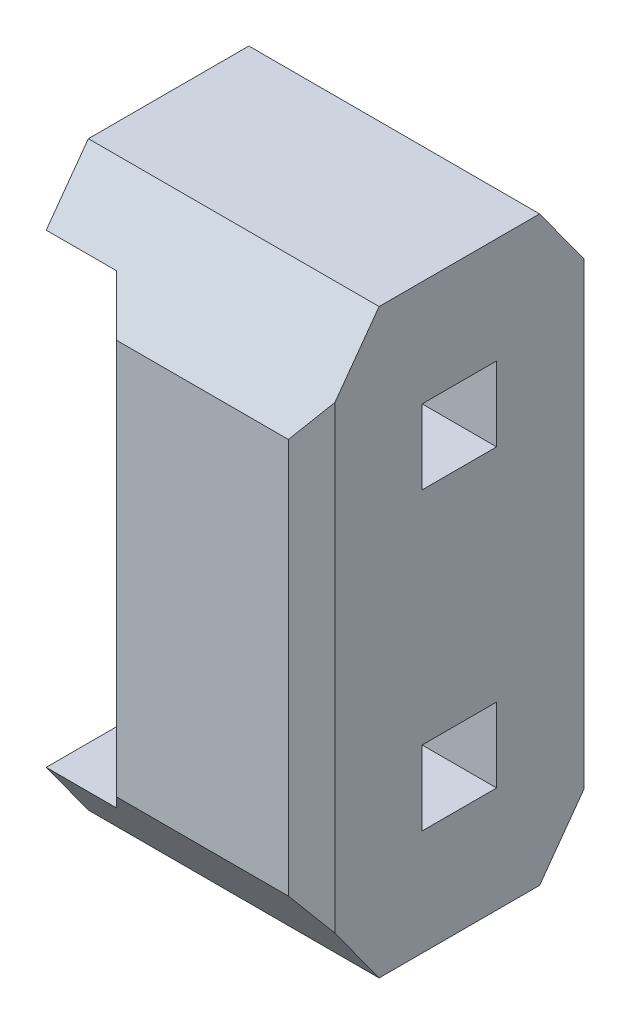
ISO-10303-21;
HEADER;
FILE_DESCRIPTION(('STEP AP214'),'2;1');
FILE_NAME('part.step','',(''),(''),'','','');
FILE_SCHEMA(('AUTOMOTIVE_DESIGN { 1 0 10303 214 1 1 1 1 }'));
ENDSEC;
DATA;
#1=APPLICATION_CONTEXT('core data for automotive mechanical design processes');
#2=APPLICATION_PROTOCOL_DEFINITION('international standard','automotive_design',2000,#1);
#3=PRODUCT_CONTEXT('',#1,'mechanical');
#4=PRODUCT('Part','Part','',(#3));
#5=PRODUCT_RELATED_PRODUCT_CATEGORY('part','',(#4));
#6=PRODUCT_DEFINITION_FORMATION('','',#4);
#7=PRODUCT_DEFINITION_CONTEXT('part definition',#1,'design');
#8=PRODUCT_DEFINITION('design','',#6,#7);
#9=PRODUCT_DEFINITION_SHAPE('','',#8);
#10=(LENGTH_UNIT() NAMED_UNIT(*) SI_UNIT(.MILLI.,.METRE.));
#11=(NAMED_UNIT(*) PLANE_ANGLE_UNIT() SI_UNIT($,.RADIAN.));
#12=(NAMED_UNIT(*) SI_UNIT($,.STERADIAN.) SOLID_ANGLE_UNIT());
#13=UNCERTAINTY_MEASURE_WITH_UNIT(LENGTH_MEASURE(1.E-05),#10,'distance_accuracy_value','');
#14=(GEOMETRIC_REPRESENTATION_CONTEXT(3) GLOBAL_UNCERTAINTY_ASSIGNED_CONTEXT((#13)) GLOBAL_UNIT_ASSIGNED_CONTEXT((#10,
#11,#12)) REPRESENTATION_CONTEXT('',''));
#15=CARTESIAN_POINT('',(0.,0.,0.));
#16=DIRECTION('',(0.,0.,1.));
#17=DIRECTION('',(1.,0.,0.));
#18=AXIS2_PLACEMENT_3D('',#15,#16,#17);
#19=CARTESIAN_POINT('',(1.25,4.6,-28.23));
#20=DIRECTION('',(0.,0.586967571460905,0.809610443394407));
#21=DIRECTION('',(0.,-0.809610443394407,0.586967571460905));
#22=AXIS2_PLACEMENT_3D('',#19,#20,#21);
#23=PLANE('',#22);
#24=DIRECTION('',(1.,0.,0.));
#25=VECTOR('',#24,1.);
#26=CARTESIAN_POINT('',(1.25,4.5,-28.1575));
#27=LINE('',#26,#25);
#28=CARTESIAN_POINT('',(0.,4.5,-28.1575));
#29=VERTEX_POINT('',#28);
#30=CARTESIAN_POINT('',(0.602500000000325,4.5,-28.1575000000001));
#31=VERTEX_POINT('',#30);
#32=EDGE_CURVE('E199',#29,#31,#27,.T.);
#33=ORIENTED_EDGE('',*,*,#32,.T.);
#34=DIRECTION('',(0.506207656348699,-0.698217457033982,0.506207656349603));
#35=VECTOR('',#34,1.);
#36=CARTESIAN_POINT('',(0.6025000000002,4.5,-28.1575));
#37=LINE('',#36,#35);
#38=CARTESIAN_POINT('',(0.819999999999671,4.2,-27.9399999999999));
#39=VERTEX_POINT('',#38);
#40=EDGE_CURVE('E197',#31,#39,#37,.T.);
#41=ORIENTED_EDGE('',*,*,#40,.T.);
#42=DIRECTION('',(1.,0.,0.));
#43=VECTOR('',#42,1.);
#44=CARTESIAN_POINT('',(1.25,4.19999999999999,-27.94));
#45=LINE('',#44,#43);
#46=CARTESIAN_POINT('',(2.30000000000012,4.2,-27.9399999999999));
#47=VERTEX_POINT('',#46);
#48=EDGE_CURVE('E20',#39,#47,#45,.T.);
#49=ORIENTED_EDGE('',*,*,#48,.T.);
#50=DIRECTION('',(0.506207656348961,0.698217457033859,-0.50620765634951));
#51=VECTOR('',#50,1.);
#52=CARTESIAN_POINT('',(2.3,4.19999999999999,-27.94));
#53=LINE('',#52,#51);
#54=CARTESIAN_POINT('',(2.49999999999988,4.47586206896591,-28.1400000000002));
#55=VERTEX_POINT('',#54);
#56=EDGE_CURVE('E181',#47,#55,#53,.T.);
#57=ORIENTED_EDGE('',*,*,#56,.T.);
#58=DIRECTION('',(0.,-0.809610443394407,0.586967571460905));
#59=VECTOR('',#58,1.);
#60=CARTESIAN_POINT('',(2.5,4.6,-28.23));
#61=LINE('',#60,#59);
#62=CARTESIAN_POINT('',(2.5,5.,-28.52));
#63=VERTEX_POINT('',#62);
#64=EDGE_CURVE('E188',#55,#63,#61,.F.);
#65=ORIENTED_EDGE('',*,*,#64,.T.);
#66=DIRECTION('',(1.,0.,0.));
#67=VECTOR('',#66,1.);
#68=CARTESIAN_POINT('',(1.25,5.,-28.52));
#69=LINE('',#68,#67);
#70=CARTESIAN_POINT('',(0.,5.,-28.52));
#71=VERTEX_POINT('',#70);
#72=EDGE_CURVE('E215',#71,#63,#69,.T.);
#73=ORIENTED_EDGE('',*,*,#72,.F.);
#74=DIRECTION('',(0.,-0.809610443394407,0.586967571460905));
#75=VECTOR('',#74,1.);
#76=CARTESIAN_POINT('',(0.,4.6,-28.23));
#77=LINE('',#76,#75);
#78=EDGE_CURVE('E207',#71,#29,#77,.T.);
#79=ORIENTED_EDGE('',*,*,#78,.T.);
#80=EDGE_LOOP('',(#33,#41,#49,#57,#65,#73,#79));
#81=FACE_BOUND('',#80,.T.);
#82=ADVANCED_FACE('F17',(#81),#23,.T.);
#83=CARTESIAN_POINT('',(1.25,4.6,-30.19));
#84=DIRECTION('',(0.,-0.586967571460905,0.809610443394407));
#85=DIRECTION('',(0.,-0.809610443394407,-0.586967571460905));
#86=AXIS2_PLACEMENT_3D('',#83,#84,#85);
#87=PLANE('',#86);
#88=DIRECTION('',(0.,-0.809610443394407,-0.586967571460905));
#89=VECTOR('',#88,1.);
#90=CARTESIAN_POINT('',(0.,4.6,-30.19));
#91=LINE('',#90,#89);
#92=CARTESIAN_POINT('',(0.,5.00000000000001,-29.9));
#93=VERTEX_POINT('',#92);
#94=CARTESIAN_POINT('',(0.,4.5,-30.2625));
#95=VERTEX_POINT('',#94);
#96=EDGE_CURVE('E263',#93,#95,#91,.T.);
#97=ORIENTED_EDGE('',*,*,#96,.F.);
#98=DIRECTION('',(1.,0.,0.));
#99=VECTOR('',#98,1.);
#100=CARTESIAN_POINT('',(1.25,5.,-29.9));
#101=LINE('',#100,#99);
#102=CARTESIAN_POINT('',(2.5,5.,-29.9));
#103=VERTEX_POINT('',#102);
#104=EDGE_CURVE('E227',#103,#93,#101,.F.);
#105=ORIENTED_EDGE('',*,*,#104,.F.);
#106=DIRECTION('',(0.,-0.809610443394407,-0.586967571460905));
#107=VECTOR('',#106,1.);
#108=CARTESIAN_POINT('',(2.5,4.6,-30.19));
#109=LINE('',#108,#107);
#110=CARTESIAN_POINT('',(2.49999999999988,4.47586206896591,-30.2799999999998));
#111=VERTEX_POINT('',#110);
#112=EDGE_CURVE('E223',#111,#103,#109,.F.);
#113=ORIENTED_EDGE('',*,*,#112,.F.);
#114=DIRECTION('',(0.506207656348961,0.698217457033859,0.50620765634951));
#115=VECTOR('',#114,1.);
#116=CARTESIAN_POINT('',(2.3,4.19999999999999,-30.48));
#117=LINE('',#116,#115);
#118=CARTESIAN_POINT('',(2.30000000000012,4.2,-30.4800000000001));
#119=VERTEX_POINT('',#118);
#120=EDGE_CURVE('E266',#119,#111,#117,.T.);
#121=ORIENTED_EDGE('',*,*,#120,.F.);
#122=DIRECTION('',(1.,0.,0.));
#123=VECTOR('',#122,1.);
#124=CARTESIAN_POINT('',(1.25,4.19999999999999,-30.48));
#125=LINE('',#124,#123);
#126=CARTESIAN_POINT('',(0.819999999999671,4.2,-30.4800000000001));
#127=VERTEX_POINT('',#126);
#128=EDGE_CURVE('E205',#127,#119,#125,.T.);
#129=ORIENTED_EDGE('',*,*,#128,.F.);
#130=DIRECTION('',(0.506207656348698,-0.698217457033983,-0.506207656349602));
#131=VECTOR('',#130,1.);
#132=CARTESIAN_POINT('',(0.6025000000002,4.5,-30.2625));
#133=LINE('',#132,#131);
#134=CARTESIAN_POINT('',(0.602500000000325,4.5,-30.2624999999999));
#135=VERTEX_POINT('',#134);
#136=EDGE_CURVE('E203',#135,#127,#133,.T.);
#137=ORIENTED_EDGE('',*,*,#136,.F.);
#138=DIRECTION('',(1.,0.,0.));
#139=VECTOR('',#138,1.);
#140=CARTESIAN_POINT('',(1.25,4.5,-30.2625));
#141=LINE('',#140,#139);
#142=EDGE_CURVE('E261',#95,#135,#141,.T.);
#143=ORIENTED_EDGE('',*,*,#142,.F.);
#144=EDGE_LOOP('',(#97,#105,#113,#121,#129,#137,#143));
#145=FACE_BOUND('',#144,.T.);
#146=ADVANCED_FACE('F285',(#145),#87,.F.);
#147=CARTESIAN_POINT('',(1.25,0.4,-30.19));
#148=DIRECTION('',(0.,0.586967571460905,0.809610443394407));
#149=DIRECTION('',(0.,-0.809610443394407,0.586967571460905));
#150=AXIS2_PLACEMENT_3D('',#147,#148,#149);
#151=PLANE('',#150);
#152=DIRECTION('',(-0.506207656349401,0.698217457033646,-0.506207656349363));
#153=VECTOR('',#152,1.);
#154=CARTESIAN_POINT('',(2.5,0.524137931034496,-30.28));
#155=LINE('',#154,#153);
#156=CARTESIAN_POINT('',(2.49999999999988,0.524137931034498,-30.2799999999999));
#157=VERTEX_POINT('',#156);
#158=CARTESIAN_POINT('',(2.30000000000012,0.800000000000005,-30.4800000000001));
#159=VERTEX_POINT('',#158);
#160=EDGE_CURVE('E251',#157,#159,#155,.T.);
#161=ORIENTED_EDGE('',*,*,#160,.F.);
#162=DIRECTION('',(0.,-0.809610443394407,0.586967571460905));
#163=VECTOR('',#162,1.);
#164=CARTESIAN_POINT('',(2.5,0.4,-30.19));
#165=LINE('',#164,#163);
#166=CARTESIAN_POINT('',(2.5,0.,-29.9));
#167=VERTEX_POINT('',#166);
#168=EDGE_CURVE('E253',#167,#157,#165,.F.);
#169=ORIENTED_EDGE('',*,*,#168,.F.);
#170=DIRECTION('',(1.,0.,0.));
#171=VECTOR('',#170,1.);
#172=CARTESIAN_POINT('',(1.25,0.,-29.9));
#173=LINE('',#172,#171);
#174=CARTESIAN_POINT('',(0.,0.,-29.9));
#175=VERTEX_POINT('',#174);
#176=EDGE_CURVE('E288',#167,#175,#173,.F.);
#177=ORIENTED_EDGE('',*,*,#176,.T.);
#178=DIRECTION('',(0.,-0.809610443394407,0.586967571460905));
#179=VECTOR('',#178,1.);
#180=CARTESIAN_POINT('',(0.,0.4,-30.19));
#181=LINE('',#180,#179);
#182=CARTESIAN_POINT('',(0.,0.500000000000001,-30.2625));
#183=VERTEX_POINT('',#182);
#184=EDGE_CURVE('E255',#183,#175,#181,.T.);
#185=ORIENTED_EDGE('',*,*,#184,.F.);
#186=DIRECTION('',(1.,0.,0.));
#187=VECTOR('',#186,1.);
#188=CARTESIAN_POINT('',(1.25,0.500000000000002,-30.2625));
#189=LINE('',#188,#187);
#190=CARTESIAN_POINT('',(0.602500000000325,0.500000000000001,-30.2624999999999));
#191=VERTEX_POINT('',#190);
#192=EDGE_CURVE('E257',#191,#183,#189,.F.);
#193=ORIENTED_EDGE('',*,*,#192,.F.);
#194=DIRECTION('',(-0.506207656348694,-0.698217457033983,0.506207656349606));
#195=VECTOR('',#194,1.);
#196=CARTESIAN_POINT('',(0.8199999999998,0.80000000000001,-30.48));
#197=LINE('',#196,#195);
#198=CARTESIAN_POINT('',(0.819999999999671,0.800000000000005,-30.4800000000001));
#199=VERTEX_POINT('',#198);
#200=EDGE_CURVE('E259',#199,#191,#197,.T.);
#201=ORIENTED_EDGE('',*,*,#200,.F.);
#202=DIRECTION('',(1.,0.,0.));
#203=VECTOR('',#202,1.);
#204=CARTESIAN_POINT('',(1.25,0.80000000000001,-30.48));
#205=LINE('',#204,#203);
#206=EDGE_CURVE('E249',#159,#199,#205,.F.);
#207=ORIENTED_EDGE('',*,*,#206,.F.);
#208=EDGE_LOOP('',(#161,#169,#177,#185,#193,#201,#207));
#209=FACE_BOUND('',#208,.T.);
#210=ADVANCED_FACE('F431',(#209),#151,.F.);
#211=CARTESIAN_POINT('',(1.25,0.4,-28.23));
#212=DIRECTION('',(0.,-0.586967571460905,0.809610443394407));
#213=DIRECTION('',(0.,-0.809610443394407,-0.586967571460905));
#214=AXIS2_PLACEMENT_3D('',#211,#212,#213);
#215=PLANE('',#214);
#216=DIRECTION('',(1.,0.,0.));
#217=VECTOR('',#216,1.);
#218=CARTESIAN_POINT('',(1.25,0.80000000000001,-27.94));
#219=LINE('',#218,#217);
#220=CARTESIAN_POINT('',(2.30000000000012,0.800000000000005,-27.9399999999999));
#221=VERTEX_POINT('',#220);
#222=CARTESIAN_POINT('',(0.819999999999671,0.800000000000005,-27.9399999999999));
#223=VERTEX_POINT('',#222);
#224=EDGE_CURVE('E191',#221,#223,#219,.F.);
#225=ORIENTED_EDGE('',*,*,#224,.T.);
#226=DIRECTION('',(-0.506207656348695,-0.698217457033982,-0.506207656349607));
#227=VECTOR('',#226,1.);
#228=CARTESIAN_POINT('',(0.8199999999998,0.80000000000001,-27.94));
#229=LINE('',#228,#227);
#230=CARTESIAN_POINT('',(0.602500000000325,0.500000000000002,-28.1575000000001));
#231=VERTEX_POINT('',#230);
#232=EDGE_CURVE('E232',#223,#231,#229,.T.);
#233=ORIENTED_EDGE('',*,*,#232,.T.);
#234=DIRECTION('',(1.,0.,0.));
#235=VECTOR('',#234,1.);
#236=CARTESIAN_POINT('',(1.25,0.500000000000003,-28.1575));
#237=LINE('',#236,#235);
#238=CARTESIAN_POINT('',(0.,0.500000000000001,-28.1575));
#239=VERTEX_POINT('',#238);
#240=EDGE_CURVE('E246',#231,#239,#237,.F.);
#241=ORIENTED_EDGE('',*,*,#240,.T.);
#242=DIRECTION('',(0.,-0.809610443394407,-0.586967571460905));
#243=VECTOR('',#242,1.);
#244=CARTESIAN_POINT('',(0.,0.4,-28.23));
#245=LINE('',#244,#243);
#246=CARTESIAN_POINT('',(0.,0.,-28.52));
#247=VERTEX_POINT('',#246);
#248=EDGE_CURVE('E244',#239,#247,#245,.T.);
#249=ORIENTED_EDGE('',*,*,#248,.T.);
#250=DIRECTION('',(1.,0.,0.));
#251=VECTOR('',#250,1.);
#252=CARTESIAN_POINT('',(1.25,0.,-28.52));
#253=LINE('',#252,#251);
#254=CARTESIAN_POINT('',(2.5,0.,-28.52));
#255=VERTEX_POINT('',#254);
#256=EDGE_CURVE('E293',#247,#255,#253,.T.);
#257=ORIENTED_EDGE('',*,*,#256,.T.);
#258=DIRECTION('',(0.,-0.809610443394407,-0.586967571460905));
#259=VECTOR('',#258,1.);
#260=CARTESIAN_POINT('',(2.5,0.4,-28.23));
#261=LINE('',#260,#259);
#262=CARTESIAN_POINT('',(2.49999999999988,0.524137931034498,-28.1400000000001));
#263=VERTEX_POINT('',#262);
#264=EDGE_CURVE('E241',#255,#263,#261,.F.);
#265=ORIENTED_EDGE('',*,*,#264,.T.);
#266=DIRECTION('',(-0.506207656349401,0.698217457033646,0.506207656349363));
#267=VECTOR('',#266,1.);
#268=CARTESIAN_POINT('',(2.5,0.524137931034496,-28.14));
#269=LINE('',#268,#267);
#270=EDGE_CURVE('E239',#263,#221,#269,.T.);
#271=ORIENTED_EDGE('',*,*,#270,.T.);
#272=EDGE_LOOP('',(#225,#233,#241,#249,#257,#265,#271));
#273=FACE_BOUND('',#272,.T.);
#274=ADVANCED_FACE('F421',(#273),#215,.T.);
#275=CARTESIAN_POINT('',(1.25,5.,-29.21));
#276=DIRECTION('',(0.,1.,0.));
#277=DIRECTION('',(0.,0.,1.));
#278=AXIS2_PLACEMENT_3D('',#275,#276,#277);
#279=PLANE('',#278);
#280=ORIENTED_EDGE('',*,*,#104,.T.);
#281=DIRECTION('',(0.,0.,-1.));
#282=VECTOR('',#281,1.);
#283=CARTESIAN_POINT('',(0.,5.,-29.21));
#284=LINE('',#283,#282);
#285=EDGE_CURVE('E231',#93,#71,#284,.F.);
#286=ORIENTED_EDGE('',*,*,#285,.T.);
#287=ORIENTED_EDGE('',*,*,#72,.T.);
#288=DIRECTION('',(0.,0.,1.));
#289=VECTOR('',#288,1.);
#290=CARTESIAN_POINT('',(2.5,5.,-29.21));
#291=LINE('',#290,#289);
#292=EDGE_CURVE('E219',#63,#103,#291,.F.);
#293=ORIENTED_EDGE('',*,*,#292,.T.);
#294=EDGE_LOOP('',(#280,#286,#287,#293));
#295=FACE_BOUND('',#294,.T.);
#296=ADVANCED_FACE('F229',(#295),#279,.T.);
#297=CARTESIAN_POINT('',(1.25,0.,-29.21));
#298=DIRECTION('',(0.,1.,0.));
#299=DIRECTION('',(0.,0.,1.));
#300=AXIS2_PLACEMENT_3D('',#297,#298,#299);
#301=PLANE('',#300);
#302=DIRECTION('',(0.,0.,-1.));
#303=VECTOR('',#302,1.);
#304=CARTESIAN_POINT('',(0.,0.,-29.21));
#305=LINE('',#304,#303);
#306=EDGE_CURVE('E297',#247,#175,#305,.T.);
#307=ORIENTED_EDGE('',*,*,#306,.T.);
#308=ORIENTED_EDGE('',*,*,#176,.F.);
#309=DIRECTION('',(0.,0.,1.));
#310=VECTOR('',#309,1.);
#311=CARTESIAN_POINT('',(2.5,0.,-29.21));
#312=LINE('',#311,#310);
#313=EDGE_CURVE('E287',#255,#167,#312,.F.);
#314=ORIENTED_EDGE('',*,*,#313,.F.);
#315=ORIENTED_EDGE('',*,*,#256,.F.);
#316=EDGE_LOOP('',(#307,#308,#314,#315));
#317=FACE_BOUND('',#316,.T.);
#318=ADVANCED_FACE('F428',(#317),#301,.F.);
#319=CARTESIAN_POINT('',(0.,4.75,-29.21));
#320=DIRECTION('',(1.,0.,0.));
#321=DIRECTION('',(0.,0.,-1.));
#322=AXIS2_PLACEMENT_3D('',#319,#320,#321);
#323=PLANE('',#322);
#324=ORIENTED_EDGE('',*,*,#285,.F.);
#325=ORIENTED_EDGE('',*,*,#96,.T.);
#326=DIRECTION('',(0.,0.,1.));
#327=VECTOR('',#326,1.);
#328=CARTESIAN_POINT('',(0.,4.5,-29.21));
#329=LINE('',#328,#327);
#330=EDGE_CURVE('E307',#95,#29,#329,.T.);
#331=ORIENTED_EDGE('',*,*,#330,.T.);
#332=ORIENTED_EDGE('',*,*,#78,.F.);
#333=EDGE_LOOP('',(#324,#325,#331,#332));
#334=FACE_BOUND('',#333,.T.);
#335=ADVANCED_FACE('F441',(#334),#323,.F.);
#336=CARTESIAN_POINT('',(0.,0.25,-29.21));
#337=DIRECTION('',(1.,0.,0.));
#338=DIRECTION('',(0.,0.,-1.));
#339=AXIS2_PLACEMENT_3D('',#336,#337,#338);
#340=PLANE('',#339);
#341=ORIENTED_EDGE('',*,*,#306,.F.);
#342=ORIENTED_EDGE('',*,*,#248,.F.);
#343=DIRECTION('',(0.,0.,1.));
#344=VECTOR('',#343,1.);
#345=CARTESIAN_POINT('',(0.,0.5,-29.21));
#346=LINE('',#345,#344);
#347=EDGE_CURVE('E315',#183,#239,#346,.T.);
#348=ORIENTED_EDGE('',*,*,#347,.F.);
#349=ORIENTED_EDGE('',*,*,#184,.T.);
#350=EDGE_LOOP('',(#341,#342,#348,#349));
#351=FACE_BOUND('',#350,.T.);
#352=ADVANCED_FACE('F443',(#351),#340,.F.);
#353=CARTESIAN_POINT('',(1.55,3.45,-29.21));
#354=DIRECTION('',(0.,1.,0.));
#355=DIRECTION('',(0.,0.,1.));
#356=AXIS2_PLACEMENT_3D('',#353,#354,#355);
#357=PLANE('',#356);
#358=DIRECTION('',(1.,0.,0.));
#359=VECTOR('',#358,1.);
#360=CARTESIAN_POINT('',(1.55,3.45,-29.53));
#361=LINE('',#360,#359);
#362=CARTESIAN_POINT('',(0.6,3.45,-29.53));
#363=VERTEX_POINT('',#362);
#364=CARTESIAN_POINT('',(2.5,3.45,-29.53));
#365=VERTEX_POINT('',#364);
#366=EDGE_CURVE('E332',#363,#365,#361,.T.);
#367=ORIENTED_EDGE('',*,*,#366,.F.);
#368=DIRECTION('',(0.,0.,1.));
#369=VECTOR('',#368,1.);
#370=CARTESIAN_POINT('',(0.6,3.45,-29.21));
#371=LINE('',#370,#369);
#372=CARTESIAN_POINT('',(0.6,3.45,-28.89));
#373=VERTEX_POINT('',#372);
#374=EDGE_CURVE('E302',#363,#373,#371,.T.);
#375=ORIENTED_EDGE('',*,*,#374,.T.);
#376=DIRECTION('',(1.,0.,0.));
#377=VECTOR('',#376,1.);
#378=CARTESIAN_POINT('',(1.55,3.45,-28.89));
#379=LINE('',#378,#377);
#380=CARTESIAN_POINT('',(2.5,3.45,-28.89));
#381=VERTEX_POINT('',#380);
#382=EDGE_CURVE('E327',#373,#381,#379,.T.);
#383=ORIENTED_EDGE('',*,*,#382,.T.);
#384=DIRECTION('',(0.,0.,1.));
#385=VECTOR('',#384,1.);
#386=CARTESIAN_POINT('',(2.5,3.45,-29.21));
#387=LINE('',#386,#385);
#388=EDGE_CURVE('E300',#381,#365,#387,.F.);
#389=ORIENTED_EDGE('',*,*,#388,.T.);
#390=EDGE_LOOP('',(#367,#375,#383,#389));
#391=FACE_BOUND('',#390,.T.);
#392=ADVANCED_FACE('F398',(#391),#357,.T.);
#393=CARTESIAN_POINT('',(0.71,2.5,-30.37));
#394=DIRECTION('',(0.707106781190498,0.,0.707106781182598));
#395=DIRECTION('',(0.707106781182598,0.,-0.707106781190498));
#396=AXIS2_PLACEMENT_3D('',#393,#394,#395);
#397=PLANE('',#396);
#398=ORIENTED_EDGE('',*,*,#200,.T.);
#399=DIRECTION('',(0.70710678118667,0.,-0.707106781186425));
#400=VECTOR('',#399,1.);
#401=CARTESIAN_POINT('',(0.6000000000002,0.5,-30.26));
#402=LINE('',#401,#400);
#403=CARTESIAN_POINT('',(0.600000000000408,0.5,-30.2599999999997));
#404=VERTEX_POINT('',#403);
#405=EDGE_CURVE('E312',#404,#191,#402,.T.);
#406=ORIENTED_EDGE('',*,*,#405,.F.);
#407=DIRECTION('',(0.,1.,0.));
#408=VECTOR('',#407,1.);
#409=CARTESIAN_POINT('',(0.6,2.5,-30.26));
#410=LINE('',#409,#408);
#411=CARTESIAN_POINT('',(0.600000000000408,4.5,-30.2599999999997));
#412=VERTEX_POINT('',#411);
#413=EDGE_CURVE('E337',#404,#412,#410,.T.);
#414=ORIENTED_EDGE('',*,*,#413,.T.);
#415=DIRECTION('',(0.70710678118667,0.,-0.707106781186425));
#416=VECTOR('',#415,1.);
#417=CARTESIAN_POINT('',(0.6000000000002,4.5,-30.26));
#418=LINE('',#417,#416);
#419=EDGE_CURVE('E304',#412,#135,#418,.T.);
#420=ORIENTED_EDGE('',*,*,#419,.T.);
#421=ORIENTED_EDGE('',*,*,#136,.T.);
#422=DIRECTION('',(0.,1.,0.));
#423=VECTOR('',#422,1.);
#424=CARTESIAN_POINT('',(0.8199999999998,2.5,-30.48));
#425=LINE('',#424,#423);
#426=EDGE_CURVE('E275',#127,#199,#425,.F.);
#427=ORIENTED_EDGE('',*,*,#426,.T.);
#428=EDGE_LOOP('',(#398,#406,#414,#420,#421,#427));
#429=FACE_BOUND('',#428,.T.);
#430=ADVANCED_FACE('F435',(#429),#397,.F.);
#431=CARTESIAN_POINT('',(0.30125,4.5,-29.21));
#432=DIRECTION('',(0.,1.,0.));
#433=DIRECTION('',(0.,0.,1.));
#434=AXIS2_PLACEMENT_3D('',#431,#432,#433);
#435=PLANE('',#434);
#436=ORIENTED_EDGE('',*,*,#142,.T.);
#437=ORIENTED_EDGE('',*,*,#419,.F.);
#438=DIRECTION('',(0.,0.,-1.));
#439=VECTOR('',#438,1.);
#440=CARTESIAN_POINT('',(0.6,4.5,-29.21));
#441=LINE('',#440,#439);
#442=CARTESIAN_POINT('',(0.600000000000279,4.5,-28.1600000000001));
#443=VERTEX_POINT('',#442);
#444=EDGE_CURVE('E339',#412,#443,#441,.F.);
#445=ORIENTED_EDGE('',*,*,#444,.T.);
#446=DIRECTION('',(-0.707106781182598,0.,-0.707106781190498));
#447=VECTOR('',#446,1.);
#448=CARTESIAN_POINT('',(0.71,4.5,-28.05));
#449=LINE('',#448,#447);
#450=EDGE_CURVE('E310',#443,#31,#449,.F.);
#451=ORIENTED_EDGE('',*,*,#450,.T.);
#452=ORIENTED_EDGE('',*,*,#32,.F.);
#453=ORIENTED_EDGE('',*,*,#330,.F.);
#454=EDGE_LOOP('',(#436,#437,#445,#451,#452,#453));
#455=FACE_BOUND('',#454,.T.);
#456=ADVANCED_FACE('F439',(#455),#435,.F.);
#457=CARTESIAN_POINT('',(0.71,2.5,-28.05));
#458=DIRECTION('',(0.707106781190498,0.,-0.707106781182598));
#459=DIRECTION('',(-0.707106781182598,0.,-0.707106781190498));
#460=AXIS2_PLACEMENT_3D('',#457,#458,#459);
#461=PLANE('',#460);
#462=ORIENTED_EDGE('',*,*,#232,.F.);
#463=DIRECTION('',(0.,1.,0.));
#464=VECTOR('',#463,1.);
#465=CARTESIAN_POINT('',(0.8199999999998,2.5,-27.94));
#466=LINE('',#465,#464);
#467=EDGE_CURVE('E325',#39,#223,#466,.F.);
#468=ORIENTED_EDGE('',*,*,#467,.F.);
#469=ORIENTED_EDGE('',*,*,#40,.F.);
#470=ORIENTED_EDGE('',*,*,#450,.F.);
#471=DIRECTION('',(0.,1.,0.));
#472=VECTOR('',#471,1.);
#473=CARTESIAN_POINT('',(0.6,2.5,-28.16));
#474=LINE('',#473,#472);
#475=CARTESIAN_POINT('',(0.600000000000408,0.5,-28.1600000000003));
#476=VERTEX_POINT('',#475);
#477=EDGE_CURVE('E341',#443,#476,#474,.F.);
#478=ORIENTED_EDGE('',*,*,#477,.T.);
#479=DIRECTION('',(-0.70710678118618,0.,-0.707106781186916));
#480=VECTOR('',#479,1.);
#481=CARTESIAN_POINT('',(0.6025000000002,0.5,-28.1575));
#482=LINE('',#481,#480);
#483=EDGE_CURVE('E318',#231,#476,#482,.T.);
#484=ORIENTED_EDGE('',*,*,#483,.F.);
#485=EDGE_LOOP('',(#462,#468,#469,#470,#478,#484));
#486=FACE_BOUND('',#485,.T.);
#487=ADVANCED_FACE('F416',(#486),#461,.F.);
#488=CARTESIAN_POINT('',(0.30125,0.5,-29.21));
#489=DIRECTION('',(0.,1.,0.));
#490=DIRECTION('',(0.,0.,1.));
#491=AXIS2_PLACEMENT_3D('',#488,#489,#490);
#492=PLANE('',#491);
#493=ORIENTED_EDGE('',*,*,#483,.T.);
#494=DIRECTION('',(0.,0.,-1.));
#495=VECTOR('',#494,1.);
#496=CARTESIAN_POINT('',(0.6,0.5,-29.21));
#497=LINE('',#496,#495);
#498=EDGE_CURVE('E343',#476,#404,#497,.T.);
#499=ORIENTED_EDGE('',*,*,#498,.T.);
#500=ORIENTED_EDGE('',*,*,#405,.T.);
#501=ORIENTED_EDGE('',*,*,#192,.T.);
#502=ORIENTED_EDGE('',*,*,#347,.T.);
#503=ORIENTED_EDGE('',*,*,#240,.F.);
#504=EDGE_LOOP('',(#493,#499,#500,#501,#502,#503));
#505=FACE_BOUND('',#504,.T.);
#506=ADVANCED_FACE('F418',(#505),#492,.T.);
#507=CARTESIAN_POINT('',(1.55,1.23,-29.53));
#508=DIRECTION('',(0.,0.,1.));
#509=DIRECTION('',(1.,0.,0.));
#510=AXIS2_PLACEMENT_3D('',#507,#508,#509);
#511=PLANE('',#510);
#512=DIRECTION('',(1.,0.,0.));
#513=VECTOR('',#512,1.);
#514=CARTESIAN_POINT('',(1.55,1.55,-29.53));
#515=LINE('',#514,#513);
#516=CARTESIAN_POINT('',(2.5,1.55,-29.53));
#517=VERTEX_POINT('',#516);
#518=CARTESIAN_POINT('',(0.6,1.55,-29.53));
#519=VERTEX_POINT('',#518);
#520=EDGE_CURVE('E283',#517,#519,#515,.F.);
#521=ORIENTED_EDGE('',*,*,#520,.T.);
#522=DIRECTION('',(0.,1.,0.));
#523=VECTOR('',#522,1.);
#524=CARTESIAN_POINT('',(0.6,2.5,-29.53));
#525=LINE('',#524,#523);
#526=CARTESIAN_POINT('',(0.6,0.91,-29.53));
#527=VERTEX_POINT('',#526);
#528=EDGE_CURVE('E346',#519,#527,#525,.F.);
#529=ORIENTED_EDGE('',*,*,#528,.T.);
#530=DIRECTION('',(1.,0.,0.));
#531=VECTOR('',#530,1.);
#532=CARTESIAN_POINT('',(1.55,0.91,-29.53));
#533=LINE('',#532,#531);
#534=CARTESIAN_POINT('',(2.5,0.91,-29.53));
#535=VERTEX_POINT('',#534);
#536=EDGE_CURVE('E354',#535,#527,#533,.F.);
#537=ORIENTED_EDGE('',*,*,#536,.F.);
#538=DIRECTION('',(0.,1.,0.));
#539=VECTOR('',#538,1.);
#540=CARTESIAN_POINT('',(2.5,1.23,-29.53));
#541=LINE('',#540,#539);
#542=EDGE_CURVE('E321',#535,#517,#541,.T.);
#543=ORIENTED_EDGE('',*,*,#542,.T.);
#544=EDGE_LOOP('',(#521,#529,#537,#543));
#545=FACE_BOUND('',#544,.T.);
#546=ADVANCED_FACE('F483',(#545),#511,.T.);
#547=CARTESIAN_POINT('',(1.56,2.5,-30.48));
#548=DIRECTION('',(0.,0.,1.));
#549=DIRECTION('',(1.,0.,0.));
#550=AXIS2_PLACEMENT_3D('',#547,#548,#549);
#551=PLANE('',#550);
#552=DIRECTION('',(0.,1.,0.));
#553=VECTOR('',#552,1.);
#554=CARTESIAN_POINT('',(2.30000000000047,2.5,-30.4800000000005));
#555=LINE('',#554,#553);
#556=EDGE_CURVE('E193',#159,#119,#555,.T.);
#557=ORIENTED_EDGE('',*,*,#556,.F.);
#558=ORIENTED_EDGE('',*,*,#206,.T.);
#559=ORIENTED_EDGE('',*,*,#426,.F.);
#560=ORIENTED_EDGE('',*,*,#128,.T.);
#561=EDGE_LOOP('',(#557,#558,#559,#560));
#562=FACE_BOUND('',#561,.T.);
#563=ADVANCED_FACE('F272',(#562),#551,.F.);
#564=CARTESIAN_POINT('',(1.56,2.5,-27.94));
#565=DIRECTION('',(0.,0.,1.));
#566=DIRECTION('',(1.,0.,0.));
#567=AXIS2_PLACEMENT_3D('',#564,#565,#566);
#568=PLANE('',#567);
#569=ORIENTED_EDGE('',*,*,#48,.F.);
#570=ORIENTED_EDGE('',*,*,#467,.T.);
#571=ORIENTED_EDGE('',*,*,#224,.F.);
#572=DIRECTION('',(0.,1.,0.));
#573=VECTOR('',#572,1.);
#574=CARTESIAN_POINT('',(2.30000000000048,2.5,-27.9399999999995));
#575=LINE('',#574,#573);
#576=EDGE_CURVE('E183',#47,#221,#575,.F.);
#577=ORIENTED_EDGE('',*,*,#576,.F.);
#578=EDGE_LOOP('',(#569,#570,#571,#577));
#579=FACE_BOUND('',#578,.T.);
#580=ADVANCED_FACE('F189',(#579),#568,.T.);
#581=CARTESIAN_POINT('',(1.55,3.77,-28.89));
#582=DIRECTION('',(0.,0.,1.));
#583=DIRECTION('',(1.,0.,0.));
#584=AXIS2_PLACEMENT_3D('',#581,#582,#583);
#585=PLANE('',#584);
#586=DIRECTION('',(0.,1.,0.));
#587=VECTOR('',#586,1.);
#588=CARTESIAN_POINT('',(2.5,3.77,-28.89));
#589=LINE('',#588,#587);
#590=CARTESIAN_POINT('',(2.5,4.09,-28.89));
#591=VERTEX_POINT('',#590);
#592=EDGE_CURVE('E330',#381,#591,#589,.T.);
#593=ORIENTED_EDGE('',*,*,#592,.F.);
#594=ORIENTED_EDGE('',*,*,#382,.F.);
#595=DIRECTION('',(0.,1.,0.));
#596=VECTOR('',#595,1.);
#597=CARTESIAN_POINT('',(0.6,2.5,-28.89));
#598=LINE('',#597,#596);
#599=CARTESIAN_POINT('',(0.6,4.09,-28.89));
#600=VERTEX_POINT('',#599);
#601=EDGE_CURVE('E351',#373,#600,#598,.T.);
#602=ORIENTED_EDGE('',*,*,#601,.T.);
#603=DIRECTION('',(1.,0.,0.));
#604=VECTOR('',#603,1.);
#605=CARTESIAN_POINT('',(1.55,4.09,-28.89));
#606=LINE('',#605,#604);
#607=EDGE_CURVE('E368',#600,#591,#606,.T.);
#608=ORIENTED_EDGE('',*,*,#607,.T.);
#609=EDGE_LOOP('',(#593,#594,#602,#608));
#610=FACE_BOUND('',#609,.T.);
#611=ADVANCED_FACE('F402',(#610),#585,.F.);
#612=CARTESIAN_POINT('',(1.55,3.77,-29.53));
#613=DIRECTION('',(0.,0.,1.));
#614=DIRECTION('',(1.,0.,0.));
#615=AXIS2_PLACEMENT_3D('',#612,#613,#614);
#616=PLANE('',#615);
#617=DIRECTION('',(1.,0.,0.));
#618=VECTOR('',#617,1.);
#619=CARTESIAN_POINT('',(1.55,4.09,-29.53));
#620=LINE('',#619,#618);
#621=CARTESIAN_POINT('',(2.5,4.09,-29.53));
#622=VERTEX_POINT('',#621);
#623=CARTESIAN_POINT('',(0.6,4.09,-29.53));
#624=VERTEX_POINT('',#623);
#625=EDGE_CURVE('E371',#622,#624,#620,.F.);
#626=ORIENTED_EDGE('',*,*,#625,.T.);
#627=DIRECTION('',(0.,1.,0.));
#628=VECTOR('',#627,1.);
#629=CARTESIAN_POINT('',(0.6,2.5,-29.53));
#630=LINE('',#629,#628);
#631=EDGE_CURVE('E348',#624,#363,#630,.F.);
#632=ORIENTED_EDGE('',*,*,#631,.T.);
#633=ORIENTED_EDGE('',*,*,#366,.T.);
#634=DIRECTION('',(0.,1.,0.));
#635=VECTOR('',#634,1.);
#636=CARTESIAN_POINT('',(2.5,3.77,-29.53));
#637=LINE('',#636,#635);
#638=EDGE_CURVE('E335',#365,#622,#637,.T.);
#639=ORIENTED_EDGE('',*,*,#638,.T.);
#640=EDGE_LOOP('',(#626,#632,#633,#639));
#641=FACE_BOUND('',#640,.T.);
#642=ADVANCED_FACE('F395',(#641),#616,.T.);
#643=CARTESIAN_POINT('',(0.6,2.5,-29.21));
#644=DIRECTION('',(1.,0.,0.));
#645=DIRECTION('',(0.,0.,-1.));
#646=AXIS2_PLACEMENT_3D('',#643,#644,#645);
#647=PLANE('',#646);
#648=ORIENTED_EDGE('',*,*,#374,.F.);
#649=ORIENTED_EDGE('',*,*,#631,.F.);
#650=DIRECTION('',(0.,0.,1.));
#651=VECTOR('',#650,1.);
#652=CARTESIAN_POINT('',(0.6,4.09,-29.21));
#653=LINE('',#652,#651);
#654=EDGE_CURVE('E192',#624,#600,#653,.T.);
#655=ORIENTED_EDGE('',*,*,#654,.T.);
#656=ORIENTED_EDGE('',*,*,#601,.F.);
#657=EDGE_LOOP('',(#648,#649,#655,#656));
#658=FACE_BOUND('',#657,.T.);
#659=ORIENTED_EDGE('',*,*,#528,.F.);
#660=DIRECTION('',(0.,0.,1.));
#661=VECTOR('',#660,1.);
#662=CARTESIAN_POINT('',(0.6,1.55,-29.21));
#663=LINE('',#662,#661);
#664=CARTESIAN_POINT('',(0.6,1.55,-28.89));
#665=VERTEX_POINT('',#664);
#666=EDGE_CURVE('E360',#519,#665,#663,.T.);
#667=ORIENTED_EDGE('',*,*,#666,.T.);
#668=DIRECTION('',(0.,1.,0.));
#669=VECTOR('',#668,1.);
#670=CARTESIAN_POINT('',(0.6,1.23,-28.89));
#671=LINE('',#670,#669);
#672=CARTESIAN_POINT('',(0.6,0.91,-28.89));
#673=VERTEX_POINT('',#672);
#674=EDGE_CURVE('E374',#665,#673,#671,.F.);
#675=ORIENTED_EDGE('',*,*,#674,.T.);
#676=DIRECTION('',(0.,0.,1.));
#677=VECTOR('',#676,1.);
#678=CARTESIAN_POINT('',(0.6,0.91,-29.21));
#679=LINE('',#678,#677);
#680=EDGE_CURVE('E357',#527,#673,#679,.T.);
#681=ORIENTED_EDGE('',*,*,#680,.F.);
#682=EDGE_LOOP('',(#659,#667,#675,#681));
#683=FACE_BOUND('',#682,.T.);
#684=ORIENTED_EDGE('',*,*,#477,.F.);
#685=ORIENTED_EDGE('',*,*,#444,.F.);
#686=ORIENTED_EDGE('',*,*,#413,.F.);
#687=ORIENTED_EDGE('',*,*,#498,.F.);
#688=EDGE_LOOP('',(#684,#685,#686,#687));
#689=FACE_BOUND('',#688,.T.);
#690=ADVANCED_FACE('F404',(#658,#683,#689),#647,.F.);
#691=CARTESIAN_POINT('',(1.55,0.91,-29.21));
#692=DIRECTION('',(0.,1.,0.));
#693=DIRECTION('',(0.,0.,1.));
#694=AXIS2_PLACEMENT_3D('',#691,#692,#693);
#695=PLANE('',#694);
#696=ORIENTED_EDGE('',*,*,#536,.T.);
#697=ORIENTED_EDGE('',*,*,#680,.T.);
#698=DIRECTION('',(1.,0.,0.));
#699=VECTOR('',#698,1.);
#700=CARTESIAN_POINT('',(1.55,0.91,-28.89));
#701=LINE('',#700,#699);
#702=CARTESIAN_POINT('',(2.5,0.91,-28.89));
#703=VERTEX_POINT('',#702);
#704=EDGE_CURVE('E376',#673,#703,#701,.T.);
#705=ORIENTED_EDGE('',*,*,#704,.T.);
#706=DIRECTION('',(0.,0.,1.));
#707=VECTOR('',#706,1.);
#708=CARTESIAN_POINT('',(2.5,0.91,-29.21));
#709=LINE('',#708,#707);
#710=EDGE_CURVE('E34',#703,#535,#709,.F.);
#711=ORIENTED_EDGE('',*,*,#710,.T.);
#712=EDGE_LOOP('',(#696,#697,#705,#711));
#713=FACE_BOUND('',#712,.T.);
#714=ADVANCED_FACE('F407',(#713),#695,.T.);
#715=CARTESIAN_POINT('',(1.55,1.55,-29.21));
#716=DIRECTION('',(0.,1.,0.));
#717=DIRECTION('',(0.,0.,1.));
#718=AXIS2_PLACEMENT_3D('',#715,#716,#717);
#719=PLANE('',#718);
#720=DIRECTION('',(0.,0.,1.));
#721=VECTOR('',#720,1.);
#722=CARTESIAN_POINT('',(2.5,1.55,-29.21));
#723=LINE('',#722,#721);
#724=CARTESIAN_POINT('',(2.5,1.55,-28.89));
#725=VERTEX_POINT('',#724);
#726=EDGE_CURVE('E362',#725,#517,#723,.F.);
#727=ORIENTED_EDGE('',*,*,#726,.F.);
#728=DIRECTION('',(1.,0.,0.));
#729=VECTOR('',#728,1.);
#730=CARTESIAN_POINT('',(1.55,1.55,-28.89));
#731=LINE('',#730,#729);
#732=EDGE_CURVE('E378',#725,#665,#731,.F.);
#733=ORIENTED_EDGE('',*,*,#732,.T.);
#734=ORIENTED_EDGE('',*,*,#666,.F.);
#735=ORIENTED_EDGE('',*,*,#520,.F.);
#736=EDGE_LOOP('',(#727,#733,#734,#735));
#737=FACE_BOUND('',#736,.T.);
#738=ADVANCED_FACE('F468',(#737),#719,.F.);
#739=CARTESIAN_POINT('',(2.4,2.5,-30.38));
#740=DIRECTION('',(0.707106781189898,0.,-0.707106781183198));
#741=DIRECTION('',(-0.707106781183198,0.,-0.707106781189898));
#742=AXIS2_PLACEMENT_3D('',#739,#740,#741);
#743=PLANE('',#742);
#744=DIRECTION('',(0.,1.,0.));
#745=VECTOR('',#744,1.);
#746=CARTESIAN_POINT('',(2.5,2.5,-30.28));
#747=LINE('',#746,#745);
#748=EDGE_CURVE('E381',#157,#111,#747,.T.);
#749=ORIENTED_EDGE('',*,*,#748,.F.);
#750=ORIENTED_EDGE('',*,*,#160,.T.);
#751=ORIENTED_EDGE('',*,*,#556,.T.);
#752=ORIENTED_EDGE('',*,*,#120,.T.);
#753=EDGE_LOOP('',(#749,#750,#751,#752));
#754=FACE_BOUND('',#753,.T.);
#755=ADVANCED_FACE('F281',(#754),#743,.T.);
#756=CARTESIAN_POINT('',(2.4,2.5,-28.04));
#757=DIRECTION('',(0.707106781189898,0.,0.707106781183198));
#758=DIRECTION('',(0.707106781183198,0.,-0.707106781189898));
#759=AXIS2_PLACEMENT_3D('',#756,#757,#758);
#760=PLANE('',#759);
#761=DIRECTION('',(0.,1.,0.));
#762=VECTOR('',#761,1.);
#763=CARTESIAN_POINT('',(2.5,2.5,-28.14));
#764=LINE('',#763,#762);
#765=EDGE_CURVE('E186',#55,#263,#764,.F.);
#766=ORIENTED_EDGE('',*,*,#765,.F.);
#767=ORIENTED_EDGE('',*,*,#56,.F.);
#768=ORIENTED_EDGE('',*,*,#576,.T.);
#769=ORIENTED_EDGE('',*,*,#270,.F.);
#770=EDGE_LOOP('',(#766,#767,#768,#769));
#771=FACE_BOUND('',#770,.T.);
#772=ADVANCED_FACE('F182',(#771),#760,.T.);
#773=CARTESIAN_POINT('',(1.55,4.09,-29.21));
#774=DIRECTION('',(0.,1.,0.));
#775=DIRECTION('',(0.,0.,1.));
#776=AXIS2_PLACEMENT_3D('',#773,#774,#775);
#777=PLANE('',#776);
#778=DIRECTION('',(0.,0.,-1.));
#779=VECTOR('',#778,1.);
#780=CARTESIAN_POINT('',(2.5,4.09,-29.21));
#781=LINE('',#780,#779);
#782=EDGE_CURVE('E26',#591,#622,#781,.T.);
#783=ORIENTED_EDGE('',*,*,#782,.F.);
#784=ORIENTED_EDGE('',*,*,#607,.F.);
#785=ORIENTED_EDGE('',*,*,#654,.F.);
#786=ORIENTED_EDGE('',*,*,#625,.F.);
#787=EDGE_LOOP('',(#783,#784,#785,#786));
#788=FACE_BOUND('',#787,.T.);
#789=ADVANCED_FACE('F392',(#788),#777,.F.);
#790=CARTESIAN_POINT('',(1.55,1.23,-28.89));
#791=DIRECTION('',(0.,0.,1.));
#792=DIRECTION('',(1.,0.,0.));
#793=AXIS2_PLACEMENT_3D('',#790,#791,#792);
#794=PLANE('',#793);
#795=DIRECTION('',(0.,1.,0.));
#796=VECTOR('',#795,1.);
#797=CARTESIAN_POINT('',(2.5,2.5,-28.89));
#798=LINE('',#797,#796);
#799=EDGE_CURVE('E11',#703,#725,#798,.T.);
#800=ORIENTED_EDGE('',*,*,#799,.F.);
#801=ORIENTED_EDGE('',*,*,#704,.F.);
#802=ORIENTED_EDGE('',*,*,#674,.F.);
#803=ORIENTED_EDGE('',*,*,#732,.F.);
#804=EDGE_LOOP('',(#800,#801,#802,#803));
#805=FACE_BOUND('',#804,.T.);
#806=ADVANCED_FACE('F454',(#805),#794,.F.);
#807=CARTESIAN_POINT('',(2.5,2.5,-29.21));
#808=DIRECTION('',(1.,0.,0.));
#809=DIRECTION('',(0.,0.,-1.));
#810=AXIS2_PLACEMENT_3D('',#807,#808,#809);
#811=PLANE('',#810);
#812=ORIENTED_EDGE('',*,*,#710,.F.);
#813=ORIENTED_EDGE('',*,*,#799,.T.);
#814=ORIENTED_EDGE('',*,*,#726,.T.);
#815=ORIENTED_EDGE('',*,*,#542,.F.);
#816=EDGE_LOOP('',(#812,#813,#814,#815));
#817=FACE_BOUND('',#816,.T.);
#818=ORIENTED_EDGE('',*,*,#592,.T.);
#819=ORIENTED_EDGE('',*,*,#782,.T.);
#820=ORIENTED_EDGE('',*,*,#638,.F.);
#821=ORIENTED_EDGE('',*,*,#388,.F.);
#822=EDGE_LOOP('',(#818,#819,#820,#821));
#823=FACE_BOUND('',#822,.T.);
#824=ORIENTED_EDGE('',*,*,#64,.F.);
#825=ORIENTED_EDGE('',*,*,#765,.T.);
#826=ORIENTED_EDGE('',*,*,#264,.F.);
#827=ORIENTED_EDGE('',*,*,#313,.T.);
#828=ORIENTED_EDGE('',*,*,#168,.T.);
#829=ORIENTED_EDGE('',*,*,#748,.T.);
#830=ORIENTED_EDGE('',*,*,#112,.T.);
#831=ORIENTED_EDGE('',*,*,#292,.F.);
#832=EDGE_LOOP('',(#824,#825,#826,#827,#828,#829,#830,#831));
#833=FACE_BOUND('',#832,.T.);
#834=ADVANCED_FACE('F220',(#817,#823,#833),#811,.T.);
#835=CLOSED_SHELL('',(#82,#146,#210,#274,#296,#318,#335,#352,#392,#430,#456,#487,#506,#546,#563,
#580,#611,#642,#690,#714,#738,#755,#772,#789,#806,#834));
#836=MANIFOLD_SOLID_BREP('B1',#835);
#837=ADVANCED_BREP_SHAPE_REPRESENTATION('',(#18,#836),#14);
#838=SHAPE_DEFINITION_REPRESENTATION(#9,#837);
ENDSEC;
END-ISO-10303-21;
